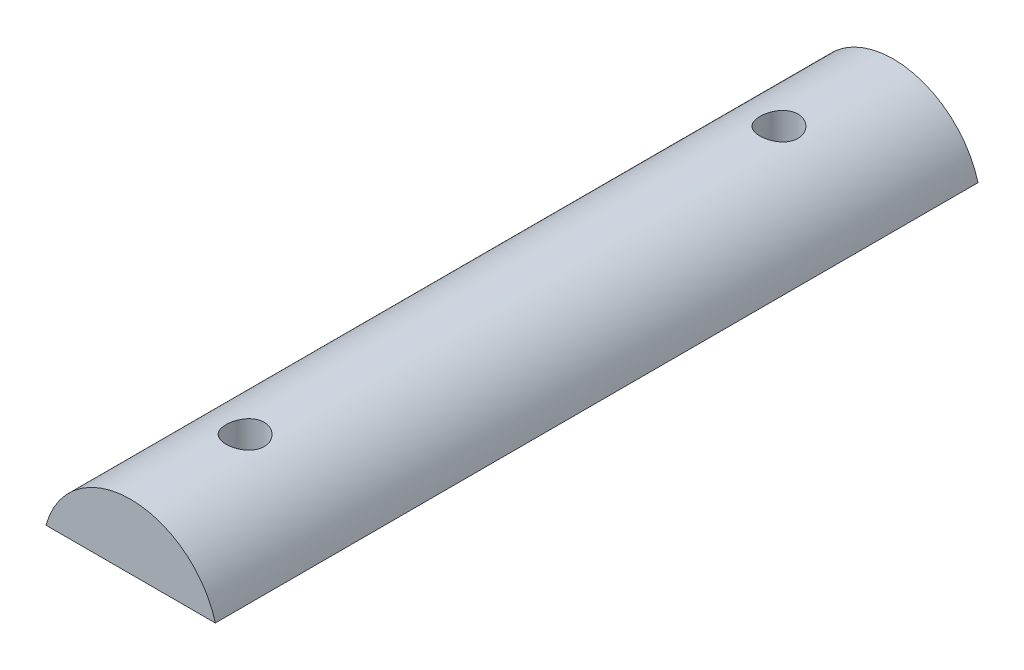
ISO-10303-21;
HEADER;
FILE_DESCRIPTION(('STEP AP214'),'2;1');
FILE_NAME('part.step','',(''),(''),'','','');
FILE_SCHEMA(('AUTOMOTIVE_DESIGN { 1 0 10303 214 1 1 1 1 }'));
ENDSEC;
DATA;
#1=APPLICATION_CONTEXT('core data for automotive mechanical design processes');
#2=APPLICATION_PROTOCOL_DEFINITION('international standard','automotive_design',2000,#1);
#3=PRODUCT_CONTEXT('',#1,'mechanical');
#4=PRODUCT('Part','Part','',(#3));
#5=PRODUCT_RELATED_PRODUCT_CATEGORY('part','',(#4));
#6=PRODUCT_DEFINITION_FORMATION('','',#4);
#7=PRODUCT_DEFINITION_CONTEXT('part definition',#1,'design');
#8=PRODUCT_DEFINITION('design','',#6,#7);
#9=PRODUCT_DEFINITION_SHAPE('','',#8);
#10=(LENGTH_UNIT() NAMED_UNIT(*) SI_UNIT(.MILLI.,.METRE.));
#11=(NAMED_UNIT(*) PLANE_ANGLE_UNIT() SI_UNIT($,.RADIAN.));
#12=(NAMED_UNIT(*) SI_UNIT($,.STERADIAN.) SOLID_ANGLE_UNIT());
#13=UNCERTAINTY_MEASURE_WITH_UNIT(LENGTH_MEASURE(1.E-05),#10,'distance_accuracy_value','');
#14=(GEOMETRIC_REPRESENTATION_CONTEXT(3) GLOBAL_UNCERTAINTY_ASSIGNED_CONTEXT((#13)) GLOBAL_UNIT_ASSIGNED_CONTEXT((#10,
#11,#12)) REPRESENTATION_CONTEXT('',''));
#15=CARTESIAN_POINT('',(0.,0.,0.));
#16=DIRECTION('',(0.,0.,1.));
#17=DIRECTION('',(1.,0.,0.));
#18=AXIS2_PLACEMENT_3D('',#15,#16,#17);
#19=CARTESIAN_POINT('',(-36.4549067110005,2.92392234053758,100.));
#20=DIRECTION('',(0.,0.,-1.));
#21=DIRECTION('',(-1.,0.,0.));
#22=AXIS2_PLACEMENT_3D('',#19,#20,#21);
#23=CYLINDRICAL_SURFACE('',#22,11.5);
#24=CARTESIAN_POINT('',(-36.4549067110005,14.4239223405376,82.5));
#25=CARTESIAN_POINT('',(-36.3162289844896,14.423919779933,82.5000047650593));
#26=CARTESIAN_POINT('',(-36.1774934852015,14.4213883734568,82.5115778653682));
#27=CARTESIAN_POINT('',(-35.9039617991859,14.4115345728023,82.5575172654708));
#28=CARTESIAN_POINT('',(-35.7691685238232,14.4042087267943,82.5918999876431));
#29=CARTESIAN_POINT('',(-35.507514052108,14.3855818970639,82.6823319620601));
#30=CARTESIAN_POINT('',(-35.3806447790437,14.3742850414028,82.738358720222));
#31=CARTESIAN_POINT('',(-35.1381119452579,14.3489360927041,82.8704173196404));
#32=CARTESIAN_POINT('',(-35.0224480670163,14.3348840777718,82.9464485938149));
#33=CARTESIAN_POINT('',(-34.8037698408252,14.3053154972085,83.1176344210567));
#34=CARTESIAN_POINT('',(-34.700958688372,14.2897809517147,83.2130454595255));
#35=CARTESIAN_POINT('',(-34.5126660504257,14.2591251413387,83.419731765165));
#36=CARTESIAN_POINT('',(-34.4271860951851,14.2440039130522,83.5310084317099));
#37=CARTESIAN_POINT('',(-34.275088138248,14.2157096678319,83.7677666213762));
#38=CARTESIAN_POINT('',(-34.2086860158577,14.2025596970385,83.8933898294737));
#39=CARTESIAN_POINT('',(-34.0980132666415,14.1799547230142,84.154344763321));
#40=CARTESIAN_POINT('',(-34.0537400281747,14.1704992837851,84.2896753412547));
#41=CARTESIAN_POINT('',(-33.9892524632985,14.1565369742738,84.564000615574));
#42=CARTESIAN_POINT('',(-33.9686786141717,14.1519562379455,84.7029069567356));
#43=CARTESIAN_POINT('',(-33.9510560423136,14.1480400992766,84.9822694178629));
#44=CARTESIAN_POINT('',(-33.9540044644032,14.1487040603244,85.1227253476697));
#45=CARTESIAN_POINT('',(-33.9830533163945,14.1551354064344,85.3985303330358));
#46=CARTESIAN_POINT('',(-34.0087365041572,14.1608108137883,85.5339258035832));
#47=CARTESIAN_POINT('',(-34.0818649782457,14.1764801991997,85.7984391169997));
#48=CARTESIAN_POINT('',(-34.1293114721687,14.1864744168965,85.9275566110782));
#49=CARTESIAN_POINT('',(-34.2450039743888,14.20974621552,86.1770239439294));
#50=CARTESIAN_POINT('',(-34.3134107835873,14.2230490248956,86.2972967585815));
#51=CARTESIAN_POINT('',(-34.4689690030474,14.2514235885414,86.5248108912239));
#52=CARTESIAN_POINT('',(-34.5561229389671,14.2664955810358,86.6320504502931));
#53=CARTESIAN_POINT('',(-34.7489119663609,14.2971051996258,86.8328565278636));
#54=CARTESIAN_POINT('',(-34.8549019507223,14.3126458962795,86.9260821866942));
#55=CARTESIAN_POINT('',(-35.081187090018,14.3421486753113,87.0934903408643));
#56=CARTESIAN_POINT('',(-35.2014824979391,14.3561107297631,87.1676724993525));
#57=CARTESIAN_POINT('',(-35.4533770189495,14.3809275341081,87.2949705466554));
#58=CARTESIAN_POINT('',(-35.5849991756303,14.3917757450682,87.3480421931409));
#59=CARTESIAN_POINT('',(-35.8555812843241,14.4090938894425,87.4312207735909));
#60=CARTESIAN_POINT('',(-35.9945401795131,14.4155644515924,87.4613310054456));
#61=CARTESIAN_POINT('',(-36.2729270429538,14.4233088921271,87.4972372382231));
#62=CARTESIAN_POINT('',(-36.4122922585754,14.4246822870134,87.5034989199804));
#63=CARTESIAN_POINT('',(-36.6900773761073,14.4223563387488,87.4927919147568));
#64=CARTESIAN_POINT('',(-36.8284973406895,14.418657335254,87.4758247832151));
#65=CARTESIAN_POINT('',(-37.0989227843845,14.4066649799341,87.4195279881823));
#66=CARTESIAN_POINT('',(-37.2309814494563,14.3984217533966,87.3804421831636));
#67=CARTESIAN_POINT('',(-37.4866684087773,14.3782634440583,87.2812879056093));
#68=CARTESIAN_POINT('',(-37.6102959898014,14.3663480510811,87.2212176605262));
#69=CARTESIAN_POINT('',(-37.8475398796784,14.3399214415405,87.0808266635119));
#70=CARTESIAN_POINT('',(-37.9609900985602,14.3253759337469,87.0002318373532));
#71=CARTESIAN_POINT('',(-38.1729228961915,14.2953733041674,86.8214408260479));
#72=CARTESIAN_POINT('',(-38.2714035533379,14.279916065698,86.7232423846917));
#73=CARTESIAN_POINT('',(-38.4524395967434,14.2494889823556,86.509895945322));
#74=CARTESIAN_POINT('',(-38.5346727188648,14.2345331175255,86.3944721273747));
#75=CARTESIAN_POINT('',(-38.6785885046644,14.2071234825977,86.1511784809766));
#76=CARTESIAN_POINT('',(-38.740272053737,14.1946696047091,86.0233091890558));
#77=CARTESIAN_POINT('',(-38.8409237916172,14.1737919892058,85.7594378304963));
#78=CARTESIAN_POINT('',(-38.8800190967554,14.1653457475,85.6234861195921));
#79=CARTESIAN_POINT('',(-38.9347580268376,14.1533985851489,85.3467360653951));
#80=CARTESIAN_POINT('',(-38.9504053494663,14.1498968847676,85.2059384898656));
#81=CARTESIAN_POINT('',(-38.9576482689265,14.1482839878171,84.9267416820845));
#82=CARTESIAN_POINT('',(-38.9497546948673,14.1500583011571,84.7883561179246));
#83=CARTESIAN_POINT('',(-38.911280809966,14.1585388147772,84.5149374255962));
#84=CARTESIAN_POINT('',(-38.8807007597466,14.1652449584002,84.3799042589337));
#85=CARTESIAN_POINT('',(-38.7979674086284,14.1827780451402,84.1174232556823));
#86=CARTESIAN_POINT('',(-38.7458875865093,14.193590942821,83.9899512584669));
#87=CARTESIAN_POINT('',(-38.6216964923289,14.218124877498,83.7454779715914));
#88=CARTESIAN_POINT('',(-38.5495831626871,14.2318462131767,83.6284777590893));
#89=CARTESIAN_POINT('',(-38.3856740287257,14.2609935971524,83.4057491676396));
#90=CARTESIAN_POINT('',(-38.2935138095773,14.2764482243729,83.3002926558253));
#91=CARTESIAN_POINT('',(-38.0928665338861,14.3071278597423,83.1061739240559));
#92=CARTESIAN_POINT('',(-37.9843757105522,14.3223528140215,83.0175155894261));
#93=CARTESIAN_POINT('',(-37.7524762341274,14.3510883546985,82.858426164179));
#94=CARTESIAN_POINT('',(-37.6288946432333,14.364574543496,82.7882425109404));
#95=CARTESIAN_POINT('',(-37.3714225436053,14.3880686331511,82.6697541803902));
#96=CARTESIAN_POINT('',(-37.2375408405777,14.3980794656451,82.6214310521531));
#97=CARTESIAN_POINT('',(-36.9954117130803,14.4116969190607,82.5567031943277));
#98=CARTESIAN_POINT('',(-36.8884795405836,14.4162531723299,82.5354798687113));
#99=CARTESIAN_POINT('',(-36.6726789691871,14.4223668235745,82.5071267056324));
#100=CARTESIAN_POINT('',(-36.563810654323,14.4239243513864,82.4999962579878));
#101=CARTESIAN_POINT('',(-36.4549067110005,14.4239223405376,82.5));
#102=B_SPLINE_CURVE_WITH_KNOTS('',3,(#24,#25,#26,#27,#28,#29,#30,#31,#32,#33,#34,#35,#36,#37,
#38,#39,#40,#41,#42,#43,#44,#45,#46,#47,#48,#49,#50,#51,#52,#53,#54,#55,#56,#57,#58,#59,#60,#61,
#62,#63,#64,#65,#66,#67,#68,#69,#70,#71,#72,#73,#74,#75,#76,#77,#78,#79,#80,#81,#82,#83,#84,#85,
#86,#87,#88,#89,#90,#91,#92,#93,#94,#95,#96,#97,#98,#99,#100,#101),.UNSPECIFIED.,.T.,.F.,(4,2,2,
2,2,2,2,2,2,2,2,2,2,2,2,2,2,2,2,2,2,2,2,2,2,2,2,2,2,2,2,2,2,2,2,2,2,2,4),(0.,0.415634564336814,
0.83156870079352,1.24707172561509,1.66256297315068,2.08396070666694,2.50539563117212,
2.93142680189745,3.35740768073596,3.77683755102814,4.19621651088047,4.60805475084517,
5.01991584555555,5.43501926087918,5.85017863499905,6.2742029821381,6.69823482912455,
7.12315071646026,7.54800556269353,7.96452059893774,8.38100774601865,8.79299016056122,
9.20500738351863,9.62284481100339,10.0407358299606,10.4662282557998,10.8917023465929,
11.3147581376294,11.7377472068679,12.151624822884,12.5654976843385,12.9779676302158,
13.390479955298,13.8112329668628,14.2320831777847,14.6583121167758,15.0841806317309,
15.4105935613292,15.73699235785),.UNSPECIFIED.);
#103=CARTESIAN_POINT('',(-36.4549067110005,14.4239223405376,82.5));
#104=VERTEX_POINT('',#103);
#105=EDGE_CURVE('E278',#104,#104,#102,.T.);
#106=ORIENTED_EDGE('',*,*,#105,.T.);
#107=EDGE_LOOP('',(#106));
#108=FACE_BOUND('',#107,.T.);
#109=CARTESIAN_POINT('',(-36.4549067110005,14.4239223405376,12.5));
#110=CARTESIAN_POINT('',(-36.3162289844896,14.423919779933,12.5000047650593));
#111=CARTESIAN_POINT('',(-36.1774934852015,14.4213883734568,12.5115778653683));
#112=CARTESIAN_POINT('',(-35.9039617991859,14.4115345728023,12.5575172654708));
#113=CARTESIAN_POINT('',(-35.7691685238232,14.4042087267943,12.5918999876431));
#114=CARTESIAN_POINT('',(-35.507514052108,14.3855818970639,12.6823319620601));
#115=CARTESIAN_POINT('',(-35.3806447790437,14.3742850414028,12.738358720222));
#116=CARTESIAN_POINT('',(-35.1381119452579,14.3489360927041,12.8704173196404));
#117=CARTESIAN_POINT('',(-35.0224480670163,14.3348840777718,12.9464485938149));
#118=CARTESIAN_POINT('',(-34.8037698408252,14.3053154972085,13.1176344210567));
#119=CARTESIAN_POINT('',(-34.700958688372,14.2897809517147,13.2130454595256));
#120=CARTESIAN_POINT('',(-34.5126660504257,14.2591251413387,13.419731765165));
#121=CARTESIAN_POINT('',(-34.4271860951851,14.2440039130522,13.5310084317099));
#122=CARTESIAN_POINT('',(-34.275088138248,14.2157096678319,13.7677666213762));
#123=CARTESIAN_POINT('',(-34.2086860158577,14.2025596970385,13.8933898294737));
#124=CARTESIAN_POINT('',(-34.0980132666415,14.1799547230142,14.1543447633211));
#125=CARTESIAN_POINT('',(-34.0537400281747,14.1704992837851,14.2896753412548));
#126=CARTESIAN_POINT('',(-33.9892524632985,14.1565369742738,14.564000615574));
#127=CARTESIAN_POINT('',(-33.9686786141717,14.1519562379455,14.7029069567357));
#128=CARTESIAN_POINT('',(-33.9510560423136,14.1480400992766,14.9822694178629));
#129=CARTESIAN_POINT('',(-33.9540044644032,14.1487040603244,15.1227253476697));
#130=CARTESIAN_POINT('',(-33.9830533163945,14.1551354064344,15.3985303330358));
#131=CARTESIAN_POINT('',(-34.0087365041572,14.1608108137883,15.5339258035832));
#132=CARTESIAN_POINT('',(-34.0818649782457,14.1764801991997,15.7984391169997));
#133=CARTESIAN_POINT('',(-34.1293114721688,14.1864744168965,15.9275566110782));
#134=CARTESIAN_POINT('',(-34.2450039743888,14.20974621552,16.1770239439294));
#135=CARTESIAN_POINT('',(-34.3134107835873,14.2230490248956,16.2972967585815));
#136=CARTESIAN_POINT('',(-34.4689690030474,14.2514235885414,16.5248108912239));
#137=CARTESIAN_POINT('',(-34.5561229389671,14.2664955810358,16.6320504502931));
#138=CARTESIAN_POINT('',(-34.7489119663609,14.2971051996258,16.8328565278636));
#139=CARTESIAN_POINT('',(-34.8549019507223,14.3126458962795,16.9260821866942));
#140=CARTESIAN_POINT('',(-35.081187090018,14.3421486753113,17.0934903408643));
#141=CARTESIAN_POINT('',(-35.2014824979391,14.3561107297631,17.1676724993525));
#142=CARTESIAN_POINT('',(-35.4533770189495,14.3809275341081,17.2949705466554));
#143=CARTESIAN_POINT('',(-35.5849991756303,14.3917757450682,17.3480421931409));
#144=CARTESIAN_POINT('',(-35.8555812843241,14.4090938894425,17.4312207735909));
#145=CARTESIAN_POINT('',(-35.9945401795131,14.4155644515924,17.4613310054456));
#146=CARTESIAN_POINT('',(-36.2729270429538,14.4233088921271,17.4972372382231));
#147=CARTESIAN_POINT('',(-36.4122922585754,14.4246822870134,17.5034989199804));
#148=CARTESIAN_POINT('',(-36.6900773761073,14.4223563387488,17.4927919147568));
#149=CARTESIAN_POINT('',(-36.8284973406895,14.418657335254,17.4758247832151));
#150=CARTESIAN_POINT('',(-37.0989227843845,14.4066649799341,17.4195279881823));
#151=CARTESIAN_POINT('',(-37.2309814494563,14.3984217533966,17.3804421831636));
#152=CARTESIAN_POINT('',(-37.4866684087773,14.3782634440583,17.2812879056094));
#153=CARTESIAN_POINT('',(-37.6102959898014,14.3663480510811,17.2212176605263));
#154=CARTESIAN_POINT('',(-37.8475398796784,14.3399214415405,17.0808266635119));
#155=CARTESIAN_POINT('',(-37.9609900985602,14.3253759337469,17.0002318373533));
#156=CARTESIAN_POINT('',(-38.1729228961915,14.2953733041674,16.8214408260479));
#157=CARTESIAN_POINT('',(-38.2714035533379,14.279916065698,16.7232423846917));
#158=CARTESIAN_POINT('',(-38.4524395967434,14.2494889823556,16.509895945322));
#159=CARTESIAN_POINT('',(-38.5346727188648,14.2345331175255,16.3944721273747));
#160=CARTESIAN_POINT('',(-38.6785885046644,14.2071234825977,16.1511784809767));
#161=CARTESIAN_POINT('',(-38.740272053737,14.1946696047091,16.0233091890558));
#162=CARTESIAN_POINT('',(-38.8409237916172,14.1737919892058,15.7594378304964));
#163=CARTESIAN_POINT('',(-38.8800190967554,14.1653457475,15.6234861195921));
#164=CARTESIAN_POINT('',(-38.9347580268376,14.1533985851489,15.3467360653951));
#165=CARTESIAN_POINT('',(-38.9504053494663,14.1498968847676,15.2059384898656));
#166=CARTESIAN_POINT('',(-38.9576482689265,14.1482839878171,14.9267416820846));
#167=CARTESIAN_POINT('',(-38.9497546948673,14.1500583011571,14.7883561179246));
#168=CARTESIAN_POINT('',(-38.911280809966,14.1585388147772,14.5149374255962));
#169=CARTESIAN_POINT('',(-38.8807007597466,14.1652449584002,14.3799042589337));
#170=CARTESIAN_POINT('',(-38.7979674086284,14.1827780451402,14.1174232556823));
#171=CARTESIAN_POINT('',(-38.7458875865093,14.193590942821,13.9899512584669));
#172=CARTESIAN_POINT('',(-38.6216964923289,14.218124877498,13.7454779715914));
#173=CARTESIAN_POINT('',(-38.5495831626871,14.2318462131767,13.6284777590893));
#174=CARTESIAN_POINT('',(-38.3856740287257,14.2609935971524,13.4057491676396));
#175=CARTESIAN_POINT('',(-38.2935138095773,14.2764482243729,13.3002926558253));
#176=CARTESIAN_POINT('',(-38.0928665338861,14.3071278597423,13.1061739240559));
#177=CARTESIAN_POINT('',(-37.9843757105522,14.3223528140215,13.0175155894261));
#178=CARTESIAN_POINT('',(-37.7524762341274,14.3510883546985,12.858426164179));
#179=CARTESIAN_POINT('',(-37.6288946432333,14.364574543496,12.7882425109405));
#180=CARTESIAN_POINT('',(-37.3714225436053,14.3880686331511,12.6697541803902));
#181=CARTESIAN_POINT('',(-37.2375408405777,14.3980794656451,12.6214310521531));
#182=CARTESIAN_POINT('',(-36.9954117130803,14.4116969190607,12.5567031943277));
#183=CARTESIAN_POINT('',(-36.8884795405836,14.4162531723299,12.5354798687113));
#184=CARTESIAN_POINT('',(-36.6726789691871,14.4223668235745,12.5071267056324));
#185=CARTESIAN_POINT('',(-36.563810654323,14.4239243513864,12.4999962579878));
#186=CARTESIAN_POINT('',(-36.4549067110005,14.4239223405376,12.5));
#187=B_SPLINE_CURVE_WITH_KNOTS('',3,(#109,#110,#111,#112,#113,#114,#115,#116,#117,#118,#119,
#120,#121,#122,#123,#124,#125,#126,#127,#128,#129,#130,#131,#132,#133,#134,#135,#136,#137,#138,
#139,#140,#141,#142,#143,#144,#145,#146,#147,#148,#149,#150,#151,#152,#153,#154,#155,#156,#157,
#158,#159,#160,#161,#162,#163,#164,#165,#166,#167,#168,#169,#170,#171,#172,#173,#174,#175,#176,
#177,#178,#179,#180,#181,#182,#183,#184,#185,#186),.UNSPECIFIED.,.T.,.F.,(4,2,2,2,2,2,2,2,2,2,2,
2,2,2,2,2,2,2,2,2,2,2,2,2,2,2,2,2,2,2,2,2,2,2,2,2,2,2,4),(0.,0.415634564336815,
0.831568700793519,1.24707172561509,1.66256297315069,2.08396070666696,2.50539563117214,
2.93142680189745,3.35740768073597,3.77683755102814,4.19621651088048,4.60805475084517,
5.01991584555555,5.43501926087916,5.85017863499904,6.2742029821381,6.69823482912454,
7.12315071646026,7.54800556269353,7.96452059893773,8.38100774601865,8.79299016056122,
9.20500738351863,9.62284481100339,10.0407358299606,10.4662282557998,10.8917023465929,
11.3147581376294,11.7377472068679,12.151624822884,12.5654976843385,12.9779676302158,
13.390479955298,13.8112329668628,14.2320831777847,14.6583121167758,15.0841806317309,
15.4105935613292,15.73699235785),.UNSPECIFIED.);
#188=CARTESIAN_POINT('',(-36.4549067110005,14.4239223405376,12.5));
#189=VERTEX_POINT('',#188);
#190=EDGE_CURVE('E161',#189,#189,#187,.T.);
#191=ORIENTED_EDGE('',*,*,#190,.T.);
#192=EDGE_LOOP('',(#191));
#193=FACE_BOUND('',#192,.T.);
#194=CARTESIAN_POINT('',(-36.4549067110005,2.92392234053758,0.));
#195=DIRECTION('',(0.,0.,1.));
#196=DIRECTION('',(1.,0.,0.));
#197=AXIS2_PLACEMENT_3D('',#194,#195,#196);
#198=CIRCLE('',#197,11.5);
#199=CARTESIAN_POINT('',(-25.3531050554132,5.92392234053758,0.));
#200=VERTEX_POINT('',#199);
#201=CARTESIAN_POINT('',(-47.5567083665877,5.92392234053758,0.));
#202=VERTEX_POINT('',#201);
#203=EDGE_CURVE('E231',#200,#202,#198,.T.);
#204=ORIENTED_EDGE('',*,*,#203,.T.);
#205=DIRECTION('',(0.,0.,-1.));
#206=VECTOR('',#205,1.);
#207=CARTESIAN_POINT('',(-47.5567083665877,5.92392234053758,100.));
#208=LINE('',#207,#206);
#209=CARTESIAN_POINT('',(-47.5567083665877,5.92392234053758,100.));
#210=VERTEX_POINT('',#209);
#211=EDGE_CURVE('E11',#210,#202,#208,.T.);
#212=ORIENTED_EDGE('',*,*,#211,.F.);
#213=CARTESIAN_POINT('',(-36.4549067110005,2.92392234053758,100.));
#214=DIRECTION('',(0.,0.,1.));
#215=DIRECTION('',(1.,0.,0.));
#216=AXIS2_PLACEMENT_3D('',#213,#214,#215);
#217=CIRCLE('',#216,11.5);
#218=CARTESIAN_POINT('',(-25.3531050554132,5.92392234053758,100.));
#219=VERTEX_POINT('',#218);
#220=EDGE_CURVE('E241',#219,#210,#217,.T.);
#221=ORIENTED_EDGE('',*,*,#220,.F.);
#222=DIRECTION('',(0.,0.,-1.));
#223=VECTOR('',#222,1.);
#224=CARTESIAN_POINT('',(-25.3531050554132,5.92392234053758,100.));
#225=LINE('',#224,#223);
#226=EDGE_CURVE('E41',#219,#200,#225,.T.);
#227=ORIENTED_EDGE('',*,*,#226,.T.);
#228=EDGE_LOOP('',(#204,#212,#221,#227));
#229=FACE_BOUND('',#228,.T.);
#230=ADVANCED_FACE('F33',(#108,#193,#229),#23,.T.);
#231=CARTESIAN_POINT('',(-47.5567083665877,5.92392234053758,100.));
#232=DIRECTION('',(0.,1.,0.));
#233=DIRECTION('',(0.,0.,1.));
#234=AXIS2_PLACEMENT_3D('',#231,#232,#233);
#235=PLANE('',#234);
#236=DIRECTION('',(0.866025403784439,0.,0.5));
#237=VECTOR('',#236,1.);
#238=CARTESIAN_POINT('',(-36.4549067110005,5.92392234053758,10.381197846483));
#239=LINE('',#238,#237);
#240=CARTESIAN_POINT('',(-36.4549067110005,5.92392234053758,10.381197846483));
#241=VERTEX_POINT('',#240);
#242=CARTESIAN_POINT('',(-32.4549067110005,5.92392234053758,12.6905989232415));
#243=VERTEX_POINT('',#242);
#244=EDGE_CURVE('E175',#241,#243,#239,.T.);
#245=ORIENTED_EDGE('',*,*,#244,.F.);
#246=DIRECTION('',(0.866025403784439,0.,-0.5));
#247=VECTOR('',#246,1.);
#248=CARTESIAN_POINT('',(-40.4549067110005,5.92392234053758,12.6905989232415));
#249=LINE('',#248,#247);
#250=CARTESIAN_POINT('',(-40.4549067110005,5.92392234053758,12.6905989232415));
#251=VERTEX_POINT('',#250);
#252=EDGE_CURVE('E48',#251,#241,#249,.T.);
#253=ORIENTED_EDGE('',*,*,#252,.F.);
#254=DIRECTION('',(0.,0.,-1.));
#255=VECTOR('',#254,1.);
#256=CARTESIAN_POINT('',(-40.4549067110005,5.92392234053758,17.3094010767585));
#257=LINE('',#256,#255);
#258=CARTESIAN_POINT('',(-40.4549067110005,5.92392234053758,17.3094010767585));
#259=VERTEX_POINT('',#258);
#260=EDGE_CURVE('E155',#259,#251,#257,.T.);
#261=ORIENTED_EDGE('',*,*,#260,.F.);
#262=DIRECTION('',(-0.866025403784439,0.,-0.5));
#263=VECTOR('',#262,1.);
#264=CARTESIAN_POINT('',(-36.4549067110005,5.92392234053758,19.6188021535171));
#265=LINE('',#264,#263);
#266=CARTESIAN_POINT('',(-36.4549067110005,5.92392234053758,19.6188021535171));
#267=VERTEX_POINT('',#266);
#268=EDGE_CURVE('E158',#267,#259,#265,.T.);
#269=ORIENTED_EDGE('',*,*,#268,.F.);
#270=DIRECTION('',(-0.866025403784438,0.,0.5));
#271=VECTOR('',#270,1.);
#272=CARTESIAN_POINT('',(-32.4549067110005,5.92392234053758,17.3094010767585));
#273=LINE('',#272,#271);
#274=CARTESIAN_POINT('',(-32.4549067110005,5.92392234053758,17.3094010767585));
#275=VERTEX_POINT('',#274);
#276=EDGE_CURVE('E180',#275,#267,#273,.T.);
#277=ORIENTED_EDGE('',*,*,#276,.F.);
#278=DIRECTION('',(0.,0.,1.));
#279=VECTOR('',#278,1.);
#280=CARTESIAN_POINT('',(-32.4549067110005,5.92392234053758,12.6905989232415));
#281=LINE('',#280,#279);
#282=EDGE_CURVE('E177',#243,#275,#281,.T.);
#283=ORIENTED_EDGE('',*,*,#282,.F.);
#284=EDGE_LOOP('',(#245,#253,#261,#269,#277,#283));
#285=FACE_BOUND('',#284,.T.);
#286=DIRECTION('',(0.866025403784439,0.,0.499999999999999));
#287=VECTOR('',#286,1.);
#288=CARTESIAN_POINT('',(-36.4549067110005,5.92392234053758,80.381197846483));
#289=LINE('',#288,#287);
#290=CARTESIAN_POINT('',(-36.4549067110005,5.92392234053758,80.381197846483));
#291=VERTEX_POINT('',#290);
#292=CARTESIAN_POINT('',(-32.4549067110004,5.92392234053758,82.6905989232415));
#293=VERTEX_POINT('',#292);
#294=EDGE_CURVE('E215',#291,#293,#289,.T.);
#295=ORIENTED_EDGE('',*,*,#294,.F.);
#296=DIRECTION('',(0.866025403784438,0.,-0.5));
#297=VECTOR('',#296,1.);
#298=CARTESIAN_POINT('',(-40.4549067110005,5.92392234053758,82.6905989232415));
#299=LINE('',#298,#297);
#300=CARTESIAN_POINT('',(-40.4549067110005,5.92392234053758,82.6905989232415));
#301=VERTEX_POINT('',#300);
#302=EDGE_CURVE('E56',#301,#291,#299,.T.);
#303=ORIENTED_EDGE('',*,*,#302,.F.);
#304=DIRECTION('',(0.,0.,-1.));
#305=VECTOR('',#304,1.);
#306=CARTESIAN_POINT('',(-40.4549067110005,5.92392234053758,87.3094010767585));
#307=LINE('',#306,#305);
#308=CARTESIAN_POINT('',(-40.4549067110005,5.92392234053758,87.3094010767585));
#309=VERTEX_POINT('',#308);
#310=EDGE_CURVE('E198',#309,#301,#307,.T.);
#311=ORIENTED_EDGE('',*,*,#310,.F.);
#312=DIRECTION('',(-0.866025403784438,0.,-0.5));
#313=VECTOR('',#312,1.);
#314=CARTESIAN_POINT('',(-36.4549067110005,5.92392234053758,89.618802153517));
#315=LINE('',#314,#313);
#316=CARTESIAN_POINT('',(-36.4549067110005,5.92392234053758,89.618802153517));
#317=VERTEX_POINT('',#316);
#318=EDGE_CURVE('E224',#317,#309,#315,.T.);
#319=ORIENTED_EDGE('',*,*,#318,.F.);
#320=DIRECTION('',(-0.866025403784439,0.,0.499999999999999));
#321=VECTOR('',#320,1.);
#322=CARTESIAN_POINT('',(-32.4549067110004,5.92392234053758,87.3094010767585));
#323=LINE('',#322,#321);
#324=CARTESIAN_POINT('',(-32.4549067110004,5.92392234053758,87.3094010767585));
#325=VERTEX_POINT('',#324);
#326=EDGE_CURVE('E221',#325,#317,#323,.T.);
#327=ORIENTED_EDGE('',*,*,#326,.F.);
#328=DIRECTION('',(0.,0.,1.));
#329=VECTOR('',#328,1.);
#330=CARTESIAN_POINT('',(-32.4549067110004,5.92392234053758,82.6905989232415));
#331=LINE('',#330,#329);
#332=EDGE_CURVE('E218',#293,#325,#331,.T.);
#333=ORIENTED_EDGE('',*,*,#332,.F.);
#334=EDGE_LOOP('',(#295,#303,#311,#319,#327,#333));
#335=FACE_BOUND('',#334,.T.);
#336=DIRECTION('',(1.,0.,0.));
#337=VECTOR('',#336,1.);
#338=CARTESIAN_POINT('',(-47.5567083665877,5.92392234053758,0.));
#339=LINE('',#338,#337);
#340=EDGE_CURVE('E245',#202,#200,#339,.T.);
#341=ORIENTED_EDGE('',*,*,#340,.T.);
#342=ORIENTED_EDGE('',*,*,#226,.F.);
#343=DIRECTION('',(1.,0.,0.));
#344=VECTOR('',#343,1.);
#345=CARTESIAN_POINT('',(-47.5567083665877,5.92392234053758,100.));
#346=LINE('',#345,#344);
#347=EDGE_CURVE('E244',#210,#219,#346,.T.);
#348=ORIENTED_EDGE('',*,*,#347,.F.);
#349=ORIENTED_EDGE('',*,*,#211,.T.);
#350=EDGE_LOOP('',(#341,#342,#348,#349));
#351=FACE_BOUND('',#350,.T.);
#352=ADVANCED_FACE('F258',(#285,#335,#351),#235,.F.);
#353=CARTESIAN_POINT('',(-36.4549067110005,2.92392234053758,100.));
#354=DIRECTION('',(0.,0.,1.));
#355=DIRECTION('',(1.,0.,0.));
#356=AXIS2_PLACEMENT_3D('',#353,#354,#355);
#357=PLANE('',#356);
#358=ORIENTED_EDGE('',*,*,#220,.T.);
#359=ORIENTED_EDGE('',*,*,#347,.T.);
#360=EDGE_LOOP('',(#358,#359));
#361=FACE_BOUND('',#360,.T.);
#362=ADVANCED_FACE('F260',(#361),#357,.T.);
#363=CARTESIAN_POINT('',(-36.4549067110005,2.92392234053758,0.));
#364=DIRECTION('',(0.,0.,1.));
#365=DIRECTION('',(1.,0.,0.));
#366=AXIS2_PLACEMENT_3D('',#363,#364,#365);
#367=PLANE('',#366);
#368=ORIENTED_EDGE('',*,*,#203,.F.);
#369=ORIENTED_EDGE('',*,*,#340,.F.);
#370=EDGE_LOOP('',(#368,#369));
#371=FACE_BOUND('',#370,.T.);
#372=ADVANCED_FACE('F257',(#371),#367,.F.);
#373=CARTESIAN_POINT('',(-40.4549067110005,9.92392234053758,82.6905989232415));
#374=DIRECTION('',(-0.5,0.,-0.866025403784438));
#375=DIRECTION('',(-0.866025403784438,0.,0.5));
#376=AXIS2_PLACEMENT_3D('',#373,#374,#375);
#377=PLANE('',#376);
#378=ORIENTED_EDGE('',*,*,#302,.T.);
#379=DIRECTION('',(0.,-1.,0.));
#380=VECTOR('',#379,1.);
#381=CARTESIAN_POINT('',(-36.4549067110005,9.92392234053758,80.381197846483));
#382=LINE('',#381,#380);
#383=CARTESIAN_POINT('',(-36.4549067110005,9.92392234053758,80.381197846483));
#384=VERTEX_POINT('',#383);
#385=EDGE_CURVE('E213',#384,#291,#382,.T.);
#386=ORIENTED_EDGE('',*,*,#385,.F.);
#387=DIRECTION('',(0.866025403784438,0.,-0.5));
#388=VECTOR('',#387,1.);
#389=CARTESIAN_POINT('',(-40.4549067110005,9.92392234053758,82.6905989232415));
#390=LINE('',#389,#388);
#391=CARTESIAN_POINT('',(-40.4549067110005,9.92392234053758,82.6905989232415));
#392=VERTEX_POINT('',#391);
#393=EDGE_CURVE('E194',#392,#384,#390,.T.);
#394=ORIENTED_EDGE('',*,*,#393,.F.);
#395=DIRECTION('',(0.,-1.,0.));
#396=VECTOR('',#395,1.);
#397=CARTESIAN_POINT('',(-40.4549067110005,9.92392234053758,82.6905989232415));
#398=LINE('',#397,#396);
#399=EDGE_CURVE('E229',#392,#301,#398,.T.);
#400=ORIENTED_EDGE('',*,*,#399,.T.);
#401=EDGE_LOOP('',(#378,#386,#394,#400));
#402=FACE_BOUND('',#401,.T.);
#403=ADVANCED_FACE('F267',(#402),#377,.F.);
#404=CARTESIAN_POINT('',(-40.4549067110005,9.92392234053758,87.3094010767585));
#405=DIRECTION('',(-1.,0.,0.));
#406=DIRECTION('',(0.,0.,1.));
#407=AXIS2_PLACEMENT_3D('',#404,#405,#406);
#408=PLANE('',#407);
#409=ORIENTED_EDGE('',*,*,#310,.T.);
#410=ORIENTED_EDGE('',*,*,#399,.F.);
#411=DIRECTION('',(0.,0.,-1.));
#412=VECTOR('',#411,1.);
#413=CARTESIAN_POINT('',(-40.4549067110005,9.92392234053758,87.3094010767585));
#414=LINE('',#413,#412);
#415=CARTESIAN_POINT('',(-40.4549067110005,9.92392234053758,87.3094010767585));
#416=VERTEX_POINT('',#415);
#417=EDGE_CURVE('E210',#416,#392,#414,.T.);
#418=ORIENTED_EDGE('',*,*,#417,.F.);
#419=DIRECTION('',(0.,-1.,0.));
#420=VECTOR('',#419,1.);
#421=CARTESIAN_POINT('',(-40.4549067110005,9.92392234053758,87.3094010767585));
#422=LINE('',#421,#420);
#423=EDGE_CURVE('E232',#416,#309,#422,.T.);
#424=ORIENTED_EDGE('',*,*,#423,.T.);
#425=EDGE_LOOP('',(#409,#410,#418,#424));
#426=FACE_BOUND('',#425,.T.);
#427=ADVANCED_FACE('F328',(#426),#408,.F.);
#428=CARTESIAN_POINT('',(-36.4549067110005,9.92392234053758,89.618802153517));
#429=DIRECTION('',(-0.5,0.,0.866025403784438));
#430=DIRECTION('',(0.866025403784438,0.,0.5));
#431=AXIS2_PLACEMENT_3D('',#428,#429,#430);
#432=PLANE('',#431);
#433=ORIENTED_EDGE('',*,*,#318,.T.);
#434=ORIENTED_EDGE('',*,*,#423,.F.);
#435=DIRECTION('',(-0.866025403784438,0.,-0.5));
#436=VECTOR('',#435,1.);
#437=CARTESIAN_POINT('',(-36.4549067110005,9.92392234053758,89.618802153517));
#438=LINE('',#437,#436);
#439=CARTESIAN_POINT('',(-36.4549067110005,9.92392234053758,89.618802153517));
#440=VERTEX_POINT('',#439);
#441=EDGE_CURVE('E207',#440,#416,#438,.T.);
#442=ORIENTED_EDGE('',*,*,#441,.F.);
#443=DIRECTION('',(0.,-1.,0.));
#444=VECTOR('',#443,1.);
#445=CARTESIAN_POINT('',(-36.4549067110005,9.92392234053758,89.618802153517));
#446=LINE('',#445,#444);
#447=EDGE_CURVE('E234',#440,#317,#446,.T.);
#448=ORIENTED_EDGE('',*,*,#447,.T.);
#449=EDGE_LOOP('',(#433,#434,#442,#448));
#450=FACE_BOUND('',#449,.T.);
#451=ADVANCED_FACE('F331',(#450),#432,.F.);
#452=CARTESIAN_POINT('',(-32.4549067110004,9.92392234053758,87.3094010767585));
#453=DIRECTION('',(0.499999999999999,0.,0.866025403784439));
#454=DIRECTION('',(0.866025403784439,0.,-0.499999999999999));
#455=AXIS2_PLACEMENT_3D('',#452,#453,#454);
#456=PLANE('',#455);
#457=ORIENTED_EDGE('',*,*,#326,.T.);
#458=ORIENTED_EDGE('',*,*,#447,.F.);
#459=DIRECTION('',(-0.866025403784439,0.,0.499999999999999));
#460=VECTOR('',#459,1.);
#461=CARTESIAN_POINT('',(-32.4549067110004,9.92392234053758,87.3094010767585));
#462=LINE('',#461,#460);
#463=CARTESIAN_POINT('',(-32.4549067110004,9.92392234053758,87.3094010767585));
#464=VERTEX_POINT('',#463);
#465=EDGE_CURVE('E204',#464,#440,#462,.T.);
#466=ORIENTED_EDGE('',*,*,#465,.F.);
#467=DIRECTION('',(0.,-1.,0.));
#468=VECTOR('',#467,1.);
#469=CARTESIAN_POINT('',(-32.4549067110004,9.92392234053758,87.3094010767585));
#470=LINE('',#469,#468);
#471=EDGE_CURVE('E236',#464,#325,#470,.T.);
#472=ORIENTED_EDGE('',*,*,#471,.T.);
#473=EDGE_LOOP('',(#457,#458,#466,#472));
#474=FACE_BOUND('',#473,.T.);
#475=ADVANCED_FACE('F335',(#474),#456,.F.);
#476=CARTESIAN_POINT('',(-32.4549067110004,9.92392234053758,82.6905989232415));
#477=DIRECTION('',(1.,0.,0.));
#478=DIRECTION('',(0.,0.,-1.));
#479=AXIS2_PLACEMENT_3D('',#476,#477,#478);
#480=PLANE('',#479);
#481=ORIENTED_EDGE('',*,*,#332,.T.);
#482=ORIENTED_EDGE('',*,*,#471,.F.);
#483=DIRECTION('',(0.,0.,1.));
#484=VECTOR('',#483,1.);
#485=CARTESIAN_POINT('',(-32.4549067110004,9.92392234053758,82.6905989232415));
#486=LINE('',#485,#484);
#487=CARTESIAN_POINT('',(-32.4549067110004,9.92392234053758,82.6905989232415));
#488=VERTEX_POINT('',#487);
#489=EDGE_CURVE('E201',#488,#464,#486,.T.);
#490=ORIENTED_EDGE('',*,*,#489,.F.);
#491=DIRECTION('',(0.,-1.,0.));
#492=VECTOR('',#491,1.);
#493=CARTESIAN_POINT('',(-32.4549067110004,9.92392234053758,82.6905989232415));
#494=LINE('',#493,#492);
#495=EDGE_CURVE('E238',#488,#293,#494,.T.);
#496=ORIENTED_EDGE('',*,*,#495,.T.);
#497=EDGE_LOOP('',(#481,#482,#490,#496));
#498=FACE_BOUND('',#497,.T.);
#499=ADVANCED_FACE('F339',(#498),#480,.F.);
#500=CARTESIAN_POINT('',(-36.4549067110005,9.92392234053758,80.381197846483));
#501=DIRECTION('',(0.499999999999999,0.,-0.866025403784439));
#502=DIRECTION('',(-0.866025403784439,0.,-0.499999999999999));
#503=AXIS2_PLACEMENT_3D('',#500,#501,#502);
#504=PLANE('',#503);
#505=ORIENTED_EDGE('',*,*,#294,.T.);
#506=ORIENTED_EDGE('',*,*,#495,.F.);
#507=DIRECTION('',(0.866025403784439,0.,0.499999999999999));
#508=VECTOR('',#507,1.);
#509=CARTESIAN_POINT('',(-36.4549067110005,9.92392234053758,80.381197846483));
#510=LINE('',#509,#508);
#511=EDGE_CURVE('E197',#384,#488,#510,.T.);
#512=ORIENTED_EDGE('',*,*,#511,.F.);
#513=ORIENTED_EDGE('',*,*,#385,.T.);
#514=EDGE_LOOP('',(#505,#506,#512,#513));
#515=FACE_BOUND('',#514,.T.);
#516=ADVANCED_FACE('F326',(#515),#504,.F.);
#517=CARTESIAN_POINT('',(0.,9.92392234053758,0.));
#518=DIRECTION('',(0.,-1.,0.));
#519=DIRECTION('',(0.,0.,-1.));
#520=AXIS2_PLACEMENT_3D('',#517,#518,#519);
#521=PLANE('',#520);
#522=CARTESIAN_POINT('',(-36.4549067110005,9.92392234053758,85.));
#523=DIRECTION('',(0.,-1.,0.));
#524=DIRECTION('',(0.,0.,-1.));
#525=AXIS2_PLACEMENT_3D('',#522,#523,#524);
#526=CIRCLE('',#525,2.5);
#527=CARTESIAN_POINT('',(-36.4549067110005,9.92392234053758,82.5));
#528=VERTEX_POINT('',#527);
#529=EDGE_CURVE('E286',#528,#528,#526,.T.);
#530=ORIENTED_EDGE('',*,*,#529,.F.);
#531=EDGE_LOOP('',(#530));
#532=FACE_BOUND('',#531,.T.);
#533=ORIENTED_EDGE('',*,*,#393,.T.);
#534=ORIENTED_EDGE('',*,*,#511,.T.);
#535=ORIENTED_EDGE('',*,*,#489,.T.);
#536=ORIENTED_EDGE('',*,*,#465,.T.);
#537=ORIENTED_EDGE('',*,*,#441,.T.);
#538=ORIENTED_EDGE('',*,*,#417,.T.);
#539=EDGE_LOOP('',(#533,#534,#535,#536,#537,#538));
#540=FACE_BOUND('',#539,.T.);
#541=ADVANCED_FACE('F323',(#532,#540),#521,.T.);
#542=CARTESIAN_POINT('',(-40.4549067110005,9.92392234053758,12.6905989232415));
#543=DIRECTION('',(-0.5,0.,-0.866025403784439));
#544=DIRECTION('',(-0.866025403784439,0.,0.5));
#545=AXIS2_PLACEMENT_3D('',#542,#543,#544);
#546=PLANE('',#545);
#547=ORIENTED_EDGE('',*,*,#252,.T.);
#548=DIRECTION('',(0.,-1.,0.));
#549=VECTOR('',#548,1.);
#550=CARTESIAN_POINT('',(-36.4549067110005,9.92392234053758,10.381197846483));
#551=LINE('',#550,#549);
#552=CARTESIAN_POINT('',(-36.4549067110005,9.92392234053758,10.381197846483));
#553=VERTEX_POINT('',#552);
#554=EDGE_CURVE('E132',#553,#241,#551,.T.);
#555=ORIENTED_EDGE('',*,*,#554,.F.);
#556=DIRECTION('',(0.866025403784439,0.,-0.5));
#557=VECTOR('',#556,1.);
#558=CARTESIAN_POINT('',(-40.4549067110005,9.92392234053758,12.6905989232415));
#559=LINE('',#558,#557);
#560=CARTESIAN_POINT('',(-40.4549067110005,9.92392234053758,12.6905989232415));
#561=VERTEX_POINT('',#560);
#562=EDGE_CURVE('E136',#561,#553,#559,.T.);
#563=ORIENTED_EDGE('',*,*,#562,.F.);
#564=DIRECTION('',(0.,-1.,0.));
#565=VECTOR('',#564,1.);
#566=CARTESIAN_POINT('',(-40.4549067110005,9.92392234053758,12.6905989232415));
#567=LINE('',#566,#565);
#568=EDGE_CURVE('E185',#561,#251,#567,.T.);
#569=ORIENTED_EDGE('',*,*,#568,.T.);
#570=EDGE_LOOP('',(#547,#555,#563,#569));
#571=FACE_BOUND('',#570,.T.);
#572=ADVANCED_FACE('F134',(#571),#546,.F.);
#573=CARTESIAN_POINT('',(-40.4549067110005,9.92392234053758,17.3094010767585));
#574=DIRECTION('',(-1.,0.,0.));
#575=DIRECTION('',(0.,0.,1.));
#576=AXIS2_PLACEMENT_3D('',#573,#574,#575);
#577=PLANE('',#576);
#578=ORIENTED_EDGE('',*,*,#260,.T.);
#579=ORIENTED_EDGE('',*,*,#568,.F.);
#580=DIRECTION('',(0.,0.,-1.));
#581=VECTOR('',#580,1.);
#582=CARTESIAN_POINT('',(-40.4549067110005,9.92392234053758,17.3094010767585));
#583=LINE('',#582,#581);
#584=CARTESIAN_POINT('',(-40.4549067110005,9.92392234053758,17.3094010767585));
#585=VERTEX_POINT('',#584);
#586=EDGE_CURVE('E142',#585,#561,#583,.T.);
#587=ORIENTED_EDGE('',*,*,#586,.F.);
#588=DIRECTION('',(0.,-1.,0.));
#589=VECTOR('',#588,1.);
#590=CARTESIAN_POINT('',(-40.4549067110005,9.92392234053758,17.3094010767585));
#591=LINE('',#590,#589);
#592=EDGE_CURVE('E187',#585,#259,#591,.T.);
#593=ORIENTED_EDGE('',*,*,#592,.T.);
#594=EDGE_LOOP('',(#578,#579,#587,#593));
#595=FACE_BOUND('',#594,.T.);
#596=ADVANCED_FACE('F303',(#595),#577,.F.);
#597=CARTESIAN_POINT('',(-36.4549067110005,9.92392234053758,19.6188021535171));
#598=DIRECTION('',(-0.5,0.,0.866025403784439));
#599=DIRECTION('',(0.866025403784439,0.,0.5));
#600=AXIS2_PLACEMENT_3D('',#597,#598,#599);
#601=PLANE('',#600);
#602=ORIENTED_EDGE('',*,*,#268,.T.);
#603=ORIENTED_EDGE('',*,*,#592,.F.);
#604=DIRECTION('',(-0.866025403784439,0.,-0.5));
#605=VECTOR('',#604,1.);
#606=CARTESIAN_POINT('',(-36.4549067110005,9.92392234053758,19.6188021535171));
#607=LINE('',#606,#605);
#608=CARTESIAN_POINT('',(-36.4549067110005,9.92392234053758,19.6188021535171));
#609=VERTEX_POINT('',#608);
#610=EDGE_CURVE('E171',#609,#585,#607,.T.);
#611=ORIENTED_EDGE('',*,*,#610,.F.);
#612=DIRECTION('',(0.,-1.,0.));
#613=VECTOR('',#612,1.);
#614=CARTESIAN_POINT('',(-36.4549067110005,9.92392234053758,19.6188021535171));
#615=LINE('',#614,#613);
#616=EDGE_CURVE('E189',#609,#267,#615,.T.);
#617=ORIENTED_EDGE('',*,*,#616,.T.);
#618=EDGE_LOOP('',(#602,#603,#611,#617));
#619=FACE_BOUND('',#618,.T.);
#620=ADVANCED_FACE('F306',(#619),#601,.F.);
#621=CARTESIAN_POINT('',(-32.4549067110005,9.92392234053758,17.3094010767585));
#622=DIRECTION('',(0.5,0.,0.866025403784438));
#623=DIRECTION('',(0.866025403784438,0.,-0.5));
#624=AXIS2_PLACEMENT_3D('',#621,#622,#623);
#625=PLANE('',#624);
#626=ORIENTED_EDGE('',*,*,#276,.T.);
#627=ORIENTED_EDGE('',*,*,#616,.F.);
#628=DIRECTION('',(-0.866025403784438,0.,0.5));
#629=VECTOR('',#628,1.);
#630=CARTESIAN_POINT('',(-32.4549067110005,9.92392234053758,17.3094010767585));
#631=LINE('',#630,#629);
#632=CARTESIAN_POINT('',(-32.4549067110005,9.92392234053758,17.3094010767585));
#633=VERTEX_POINT('',#632);
#634=EDGE_CURVE('E168',#633,#609,#631,.T.);
#635=ORIENTED_EDGE('',*,*,#634,.F.);
#636=DIRECTION('',(0.,-1.,0.));
#637=VECTOR('',#636,1.);
#638=CARTESIAN_POINT('',(-32.4549067110005,9.92392234053758,17.3094010767585));
#639=LINE('',#638,#637);
#640=EDGE_CURVE('E191',#633,#275,#639,.T.);
#641=ORIENTED_EDGE('',*,*,#640,.T.);
#642=EDGE_LOOP('',(#626,#627,#635,#641));
#643=FACE_BOUND('',#642,.T.);
#644=ADVANCED_FACE('F310',(#643),#625,.F.);
#645=CARTESIAN_POINT('',(-32.4549067110005,9.92392234053758,12.6905989232415));
#646=DIRECTION('',(1.,0.,0.));
#647=DIRECTION('',(0.,0.,-1.));
#648=AXIS2_PLACEMENT_3D('',#645,#646,#647);
#649=PLANE('',#648);
#650=ORIENTED_EDGE('',*,*,#282,.T.);
#651=ORIENTED_EDGE('',*,*,#640,.F.);
#652=DIRECTION('',(0.,0.,1.));
#653=VECTOR('',#652,1.);
#654=CARTESIAN_POINT('',(-32.4549067110005,9.92392234053758,12.6905989232415));
#655=LINE('',#654,#653);
#656=CARTESIAN_POINT('',(-32.4549067110005,9.92392234053758,12.6905989232415));
#657=VERTEX_POINT('',#656);
#658=EDGE_CURVE('E150',#657,#633,#655,.T.);
#659=ORIENTED_EDGE('',*,*,#658,.F.);
#660=DIRECTION('',(0.,-1.,0.));
#661=VECTOR('',#660,1.);
#662=CARTESIAN_POINT('',(-32.4549067110005,9.92392234053758,12.6905989232415));
#663=LINE('',#662,#661);
#664=EDGE_CURVE('E141',#657,#243,#663,.T.);
#665=ORIENTED_EDGE('',*,*,#664,.T.);
#666=EDGE_LOOP('',(#650,#651,#659,#665));
#667=FACE_BOUND('',#666,.T.);
#668=ADVANCED_FACE('F314',(#667),#649,.F.);
#669=CARTESIAN_POINT('',(-36.4549067110005,9.92392234053758,10.381197846483));
#670=DIRECTION('',(0.5,0.,-0.866025403784439));
#671=DIRECTION('',(-0.866025403784439,0.,-0.5));
#672=AXIS2_PLACEMENT_3D('',#669,#670,#671);
#673=PLANE('',#672);
#674=ORIENTED_EDGE('',*,*,#244,.T.);
#675=ORIENTED_EDGE('',*,*,#664,.F.);
#676=DIRECTION('',(0.866025403784439,0.,0.5));
#677=VECTOR('',#676,1.);
#678=CARTESIAN_POINT('',(-36.4549067110005,9.92392234053758,10.381197846483));
#679=LINE('',#678,#677);
#680=EDGE_CURVE('E145',#553,#657,#679,.T.);
#681=ORIENTED_EDGE('',*,*,#680,.F.);
#682=ORIENTED_EDGE('',*,*,#554,.T.);
#683=EDGE_LOOP('',(#674,#675,#681,#682));
#684=FACE_BOUND('',#683,.T.);
#685=ADVANCED_FACE('F146',(#684),#673,.F.);
#686=CARTESIAN_POINT('',(0.,9.92392234053758,0.));
#687=DIRECTION('',(0.,-1.,0.));
#688=DIRECTION('',(0.,0.,-1.));
#689=AXIS2_PLACEMENT_3D('',#686,#687,#688);
#690=PLANE('',#689);
#691=CARTESIAN_POINT('',(-36.4549067110005,9.92392234053758,15.));
#692=DIRECTION('',(0.,-1.,0.));
#693=DIRECTION('',(0.,0.,-1.));
#694=AXIS2_PLACEMENT_3D('',#691,#692,#693);
#695=CIRCLE('',#694,2.5);
#696=CARTESIAN_POINT('',(-36.4549067110005,9.92392234053758,12.5));
#697=VERTEX_POINT('',#696);
#698=EDGE_CURVE('E282',#697,#697,#695,.T.);
#699=ORIENTED_EDGE('',*,*,#698,.F.);
#700=EDGE_LOOP('',(#699));
#701=FACE_BOUND('',#700,.T.);
#702=ORIENTED_EDGE('',*,*,#562,.T.);
#703=ORIENTED_EDGE('',*,*,#680,.T.);
#704=ORIENTED_EDGE('',*,*,#658,.T.);
#705=ORIENTED_EDGE('',*,*,#634,.T.);
#706=ORIENTED_EDGE('',*,*,#610,.T.);
#707=ORIENTED_EDGE('',*,*,#586,.T.);
#708=EDGE_LOOP('',(#702,#703,#704,#705,#706,#707));
#709=FACE_BOUND('',#708,.T.);
#710=ADVANCED_FACE('F152',(#701,#709),#690,.T.);
#711=CARTESIAN_POINT('',(-36.4549067110005,23.9239223405376,15.));
#712=DIRECTION('',(0.,-1.,0.));
#713=DIRECTION('',(0.,0.,-1.));
#714=AXIS2_PLACEMENT_3D('',#711,#712,#713);
#715=CYLINDRICAL_SURFACE('',#714,2.5);
#716=ORIENTED_EDGE('',*,*,#698,.T.);
#717=EDGE_LOOP('',(#716));
#718=FACE_BOUND('',#717,.T.);
#719=ORIENTED_EDGE('',*,*,#190,.F.);
#720=EDGE_LOOP('',(#719));
#721=FACE_BOUND('',#720,.T.);
#722=ADVANCED_FACE('F295',(#718,#721),#715,.F.);
#723=CARTESIAN_POINT('',(-36.4549067110005,23.9239223405376,85.));
#724=DIRECTION('',(0.,-1.,0.));
#725=DIRECTION('',(0.,0.,-1.));
#726=AXIS2_PLACEMENT_3D('',#723,#724,#725);
#727=CYLINDRICAL_SURFACE('',#726,2.5);
#728=ORIENTED_EDGE('',*,*,#529,.T.);
#729=EDGE_LOOP('',(#728));
#730=FACE_BOUND('',#729,.T.);
#731=ORIENTED_EDGE('',*,*,#105,.F.);
#732=EDGE_LOOP('',(#731));
#733=FACE_BOUND('',#732,.T.);
#734=ADVANCED_FACE('F292',(#730,#733),#727,.F.);
#735=CLOSED_SHELL('',(#230,#352,#362,#372,#403,#427,#451,#475,#499,#516,#541,#572,#596,#620,
#644,#668,#685,#710,#722,#734));
#736=MANIFOLD_SOLID_BREP('B2',#735);
#737=ADVANCED_BREP_SHAPE_REPRESENTATION('',(#18,#736),#14);
#738=SHAPE_DEFINITION_REPRESENTATION(#9,#737);
ENDSEC;
END-ISO-10303-21;
